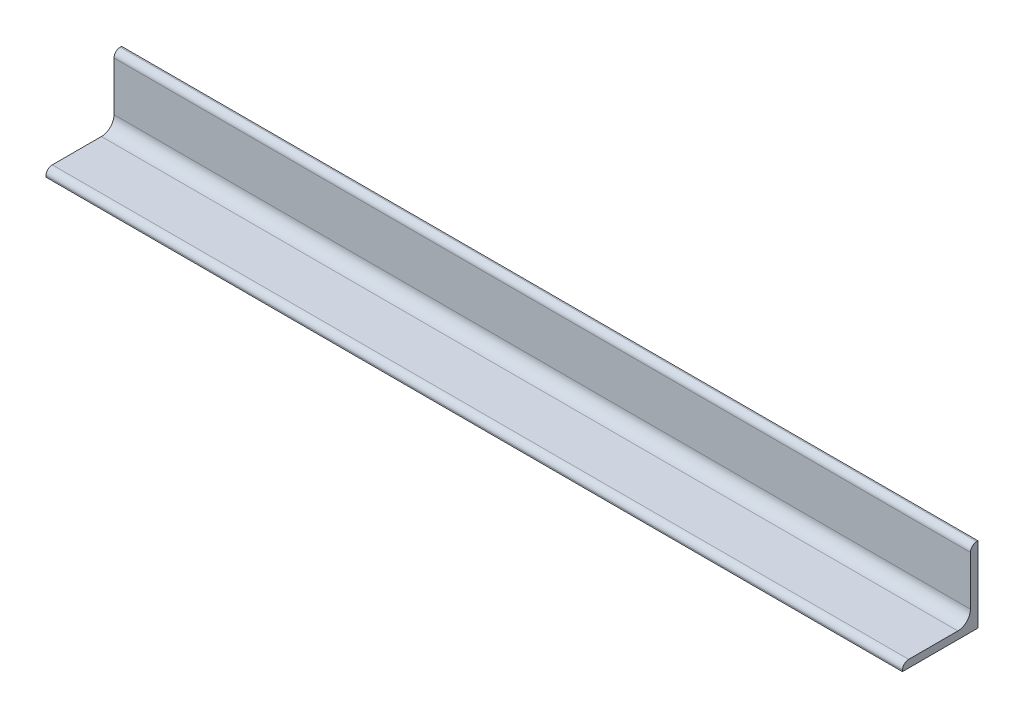
ISO-10303-21;
HEADER;
FILE_DESCRIPTION(('STEP AP214'),'2;1');
FILE_NAME('part.step','',(''),(''),'','','');
FILE_SCHEMA(('AUTOMOTIVE_DESIGN { 1 0 10303 214 1 1 1 1 }'));
ENDSEC;
DATA;
#1=APPLICATION_CONTEXT('core data for automotive mechanical design processes');
#2=APPLICATION_PROTOCOL_DEFINITION('international standard','automotive_design',2000,#1);
#3=PRODUCT_CONTEXT('',#1,'mechanical');
#4=PRODUCT('Part','Part','',(#3));
#5=PRODUCT_RELATED_PRODUCT_CATEGORY('part','',(#4));
#6=PRODUCT_DEFINITION_FORMATION('','',#4);
#7=PRODUCT_DEFINITION_CONTEXT('part definition',#1,'design');
#8=PRODUCT_DEFINITION('design','',#6,#7);
#9=PRODUCT_DEFINITION_SHAPE('','',#8);
#10=(LENGTH_UNIT() NAMED_UNIT(*) SI_UNIT(.MILLI.,.METRE.));
#11=(NAMED_UNIT(*) PLANE_ANGLE_UNIT() SI_UNIT($,.RADIAN.));
#12=(NAMED_UNIT(*) SI_UNIT($,.STERADIAN.) SOLID_ANGLE_UNIT());
#13=UNCERTAINTY_MEASURE_WITH_UNIT(LENGTH_MEASURE(1.E-05),#10,'distance_accuracy_value','');
#14=(GEOMETRIC_REPRESENTATION_CONTEXT(3) GLOBAL_UNCERTAINTY_ASSIGNED_CONTEXT((#13)) GLOBAL_UNIT_ASSIGNED_CONTEXT((#10,
#11,#12)) REPRESENTATION_CONTEXT('',''));
#15=CARTESIAN_POINT('',(0.,0.,0.));
#16=DIRECTION('',(0.,0.,1.));
#17=DIRECTION('',(1.,0.,0.));
#18=AXIS2_PLACEMENT_3D('',#15,#16,#17);
#19=CARTESIAN_POINT('',(-170.,27.5,0.500000000000005));
#20=DIRECTION('',(1.,0.,0.));
#21=DIRECTION('',(0.,0.,-1.));
#22=AXIS2_PLACEMENT_3D('',#19,#20,#21);
#23=PLANE('',#22);
#24=DIRECTION('',(0.,0.,1.));
#25=VECTOR('',#24,1.);
#26=CARTESIAN_POINT('',(-170.,0.,30.));
#27=LINE('',#26,#25);
#28=CARTESIAN_POINT('',(-170.,0.,0.));
#29=VERTEX_POINT('',#28);
#30=CARTESIAN_POINT('',(-170.,0.,30.));
#31=VERTEX_POINT('',#30);
#32=EDGE_CURVE('E124',#29,#31,#27,.T.);
#33=ORIENTED_EDGE('',*,*,#32,.T.);
#34=DIRECTION('',(0.,1.,0.));
#35=VECTOR('',#34,1.);
#36=CARTESIAN_POINT('',(-170.,0.499999999999992,30.));
#37=LINE('',#36,#35);
#38=CARTESIAN_POINT('',(-170.,0.499999999999992,30.));
#39=VERTEX_POINT('',#38);
#40=EDGE_CURVE('E131',#31,#39,#37,.T.);
#41=ORIENTED_EDGE('',*,*,#40,.T.);
#42=CARTESIAN_POINT('',(-170.,0.499999999999992,27.5));
#43=DIRECTION('',(-1.,0.,0.));
#44=DIRECTION('',(0.,0.,1.));
#45=AXIS2_PLACEMENT_3D('',#42,#43,#44);
#46=CIRCLE('',#45,2.5);
#47=CARTESIAN_POINT('',(-170.,2.99999999999999,27.5));
#48=VERTEX_POINT('',#47);
#49=EDGE_CURVE('E141',#39,#48,#46,.T.);
#50=ORIENTED_EDGE('',*,*,#49,.T.);
#51=DIRECTION('',(0.,0.,-1.));
#52=VECTOR('',#51,1.);
#53=CARTESIAN_POINT('',(-170.,2.99999999999999,8.00000000000001));
#54=LINE('',#53,#52);
#55=CARTESIAN_POINT('',(-170.,3.,8.00000000000001));
#56=VERTEX_POINT('',#55);
#57=EDGE_CURVE('E150',#48,#56,#54,.T.);
#58=ORIENTED_EDGE('',*,*,#57,.T.);
#59=CARTESIAN_POINT('',(-170.,8.,8.00000000000001));
#60=DIRECTION('',(1.,0.,0.));
#61=DIRECTION('',(0.,0.,-1.));
#62=AXIS2_PLACEMENT_3D('',#59,#60,#61);
#63=CIRCLE('',#62,5.);
#64=CARTESIAN_POINT('',(-170.,8.,3.00000000000001));
#65=VERTEX_POINT('',#64);
#66=EDGE_CURVE('E158',#56,#65,#63,.T.);
#67=ORIENTED_EDGE('',*,*,#66,.T.);
#68=DIRECTION('',(0.,1.,0.));
#69=VECTOR('',#68,1.);
#70=CARTESIAN_POINT('',(-170.,27.5,3.));
#71=LINE('',#70,#69);
#72=CARTESIAN_POINT('',(-170.,27.5,3.00000000000001));
#73=VERTEX_POINT('',#72);
#74=EDGE_CURVE('E166',#65,#73,#71,.T.);
#75=ORIENTED_EDGE('',*,*,#74,.T.);
#76=CARTESIAN_POINT('',(-170.,27.5,0.500000000000005));
#77=DIRECTION('',(-1.,0.,0.));
#78=DIRECTION('',(0.,0.,-1.));
#79=AXIS2_PLACEMENT_3D('',#76,#77,#78);
#80=CIRCLE('',#79,2.5);
#81=CARTESIAN_POINT('',(-170.,30.,0.500000000000005));
#82=VERTEX_POINT('',#81);
#83=EDGE_CURVE('E88',#73,#82,#80,.T.);
#84=ORIENTED_EDGE('',*,*,#83,.T.);
#85=DIRECTION('',(0.,0.,-1.));
#86=VECTOR('',#85,1.);
#87=CARTESIAN_POINT('',(-170.,30.,0.));
#88=LINE('',#87,#86);
#89=CARTESIAN_POINT('',(-170.,30.,0.));
#90=VERTEX_POINT('',#89);
#91=EDGE_CURVE('E83',#82,#90,#88,.T.);
#92=ORIENTED_EDGE('',*,*,#91,.T.);
#93=DIRECTION('',(0.,-1.,0.));
#94=VECTOR('',#93,1.);
#95=CARTESIAN_POINT('',(-170.,30.,0.));
#96=LINE('',#95,#94);
#97=EDGE_CURVE('E77',#90,#29,#96,.T.);
#98=ORIENTED_EDGE('',*,*,#97,.T.);
#99=EDGE_LOOP('',(#33,#41,#50,#58,#67,#75,#84,#92,#98));
#100=FACE_BOUND('',#99,.T.);
#101=ADVANCED_FACE('F41',(#100),#23,.F.);
#102=CARTESIAN_POINT('',(170.,27.5,0.500000000000005));
#103=DIRECTION('',(1.,0.,0.));
#104=DIRECTION('',(0.,0.,-1.));
#105=AXIS2_PLACEMENT_3D('',#102,#103,#104);
#106=PLANE('',#105);
#107=DIRECTION('',(0.,0.,1.));
#108=VECTOR('',#107,1.);
#109=CARTESIAN_POINT('',(170.,0.,30.));
#110=LINE('',#109,#108);
#111=CARTESIAN_POINT('',(170.,0.,0.));
#112=VERTEX_POINT('',#111);
#113=CARTESIAN_POINT('',(170.,0.,30.));
#114=VERTEX_POINT('',#113);
#115=EDGE_CURVE('E135',#112,#114,#110,.T.);
#116=ORIENTED_EDGE('',*,*,#115,.F.);
#117=DIRECTION('',(0.,-1.,0.));
#118=VECTOR('',#117,1.);
#119=CARTESIAN_POINT('',(170.,30.,0.));
#120=LINE('',#119,#118);
#121=CARTESIAN_POINT('',(170.,30.,0.));
#122=VERTEX_POINT('',#121);
#123=EDGE_CURVE('E11',#122,#112,#120,.T.);
#124=ORIENTED_EDGE('',*,*,#123,.F.);
#125=DIRECTION('',(0.,0.,-1.));
#126=VECTOR('',#125,1.);
#127=CARTESIAN_POINT('',(170.,30.,0.));
#128=LINE('',#127,#126);
#129=CARTESIAN_POINT('',(170.,30.,0.500000000000005));
#130=VERTEX_POINT('',#129);
#131=EDGE_CURVE('E55',#130,#122,#128,.T.);
#132=ORIENTED_EDGE('',*,*,#131,.F.);
#133=CARTESIAN_POINT('',(170.,27.5,0.500000000000005));
#134=DIRECTION('',(-1.,0.,0.));
#135=DIRECTION('',(0.,0.,-1.));
#136=AXIS2_PLACEMENT_3D('',#133,#134,#135);
#137=CIRCLE('',#136,2.5);
#138=CARTESIAN_POINT('',(170.,27.5,3.00000000000001));
#139=VERTEX_POINT('',#138);
#140=EDGE_CURVE('E64',#139,#130,#137,.T.);
#141=ORIENTED_EDGE('',*,*,#140,.F.);
#142=DIRECTION('',(0.,1.,0.));
#143=VECTOR('',#142,1.);
#144=CARTESIAN_POINT('',(170.,27.5,3.));
#145=LINE('',#144,#143);
#146=CARTESIAN_POINT('',(170.,8.,3.00000000000001));
#147=VERTEX_POINT('',#146);
#148=EDGE_CURVE('E171',#147,#139,#145,.T.);
#149=ORIENTED_EDGE('',*,*,#148,.F.);
#150=CARTESIAN_POINT('',(170.,8.,8.00000000000001));
#151=DIRECTION('',(1.,0.,0.));
#152=DIRECTION('',(0.,0.,-1.));
#153=AXIS2_PLACEMENT_3D('',#150,#151,#152);
#154=CIRCLE('',#153,5.);
#155=CARTESIAN_POINT('',(170.,3.,8.00000000000001));
#156=VERTEX_POINT('',#155);
#157=EDGE_CURVE('E163',#156,#147,#154,.T.);
#158=ORIENTED_EDGE('',*,*,#157,.F.);
#159=DIRECTION('',(0.,0.,-1.));
#160=VECTOR('',#159,1.);
#161=CARTESIAN_POINT('',(170.,2.99999999999999,8.00000000000001));
#162=LINE('',#161,#160);
#163=CARTESIAN_POINT('',(170.,2.99999999999999,27.5));
#164=VERTEX_POINT('',#163);
#165=EDGE_CURVE('E155',#164,#156,#162,.T.);
#166=ORIENTED_EDGE('',*,*,#165,.F.);
#167=CARTESIAN_POINT('',(170.,0.499999999999992,27.5));
#168=DIRECTION('',(-1.,0.,0.));
#169=DIRECTION('',(0.,0.,1.));
#170=AXIS2_PLACEMENT_3D('',#167,#168,#169);
#171=CIRCLE('',#170,2.5);
#172=CARTESIAN_POINT('',(170.,0.499999999999992,30.));
#173=VERTEX_POINT('',#172);
#174=EDGE_CURVE('E147',#173,#164,#171,.T.);
#175=ORIENTED_EDGE('',*,*,#174,.F.);
#176=DIRECTION('',(0.,1.,0.));
#177=VECTOR('',#176,1.);
#178=CARTESIAN_POINT('',(170.,0.499999999999992,30.));
#179=LINE('',#178,#177);
#180=EDGE_CURVE('E142',#114,#173,#179,.T.);
#181=ORIENTED_EDGE('',*,*,#180,.F.);
#182=EDGE_LOOP('',(#116,#124,#132,#141,#149,#158,#166,#175,#181));
#183=FACE_BOUND('',#182,.T.);
#184=ADVANCED_FACE('F194',(#183),#106,.T.);
#185=CARTESIAN_POINT('',(-170.,0.,30.));
#186=DIRECTION('',(0.,1.,0.));
#187=DIRECTION('',(0.,0.,1.));
#188=AXIS2_PLACEMENT_3D('',#185,#186,#187);
#189=PLANE('',#188);
#190=DIRECTION('',(1.,0.,0.));
#191=VECTOR('',#190,1.);
#192=CARTESIAN_POINT('',(-170.,0.,30.));
#193=LINE('',#192,#191);
#194=EDGE_CURVE('E128',#31,#114,#193,.T.);
#195=ORIENTED_EDGE('',*,*,#194,.F.);
#196=ORIENTED_EDGE('',*,*,#32,.F.);
#197=DIRECTION('',(1.,0.,0.));
#198=VECTOR('',#197,1.);
#199=CARTESIAN_POINT('',(-170.,0.,0.));
#200=LINE('',#199,#198);
#201=EDGE_CURVE('E126',#29,#112,#200,.T.);
#202=ORIENTED_EDGE('',*,*,#201,.T.);
#203=ORIENTED_EDGE('',*,*,#115,.T.);
#204=EDGE_LOOP('',(#195,#196,#202,#203));
#205=FACE_BOUND('',#204,.T.);
#206=ADVANCED_FACE('F125',(#205),#189,.F.);
#207=CARTESIAN_POINT('',(-170.,0.499999999999992,30.));
#208=DIRECTION('',(0.,0.,-1.));
#209=DIRECTION('',(-1.,0.,0.));
#210=AXIS2_PLACEMENT_3D('',#207,#208,#209);
#211=PLANE('',#210);
#212=DIRECTION('',(1.,0.,0.));
#213=VECTOR('',#212,1.);
#214=CARTESIAN_POINT('',(-170.,0.499999999999992,30.));
#215=LINE('',#214,#213);
#216=EDGE_CURVE('E144',#39,#173,#215,.T.);
#217=ORIENTED_EDGE('',*,*,#216,.F.);
#218=ORIENTED_EDGE('',*,*,#40,.F.);
#219=ORIENTED_EDGE('',*,*,#194,.T.);
#220=ORIENTED_EDGE('',*,*,#180,.T.);
#221=EDGE_LOOP('',(#217,#218,#219,#220));
#222=FACE_BOUND('',#221,.T.);
#223=ADVANCED_FACE('F201',(#222),#211,.F.);
#224=CARTESIAN_POINT('',(-170.,0.499999999999992,27.5));
#225=DIRECTION('',(1.,0.,0.));
#226=DIRECTION('',(0.,0.,-1.));
#227=AXIS2_PLACEMENT_3D('',#224,#225,#226);
#228=CYLINDRICAL_SURFACE('',#227,2.5);
#229=DIRECTION('',(1.,0.,0.));
#230=VECTOR('',#229,1.);
#231=CARTESIAN_POINT('',(-170.,2.99999999999999,27.5));
#232=LINE('',#231,#230);
#233=EDGE_CURVE('E152',#48,#164,#232,.T.);
#234=ORIENTED_EDGE('',*,*,#233,.F.);
#235=ORIENTED_EDGE('',*,*,#49,.F.);
#236=ORIENTED_EDGE('',*,*,#216,.T.);
#237=ORIENTED_EDGE('',*,*,#174,.T.);
#238=EDGE_LOOP('',(#234,#235,#236,#237));
#239=FACE_BOUND('',#238,.T.);
#240=ADVANCED_FACE('F211',(#239),#228,.T.);
#241=CARTESIAN_POINT('',(-170.,2.99999999999999,8.00000000000001));
#242=DIRECTION('',(0.,-1.,0.));
#243=DIRECTION('',(0.,0.,-1.));
#244=AXIS2_PLACEMENT_3D('',#241,#242,#243);
#245=PLANE('',#244);
#246=DIRECTION('',(1.,0.,0.));
#247=VECTOR('',#246,1.);
#248=CARTESIAN_POINT('',(-170.,3.,8.00000000000001));
#249=LINE('',#248,#247);
#250=EDGE_CURVE('E160',#56,#156,#249,.T.);
#251=ORIENTED_EDGE('',*,*,#250,.F.);
#252=ORIENTED_EDGE('',*,*,#57,.F.);
#253=ORIENTED_EDGE('',*,*,#233,.T.);
#254=ORIENTED_EDGE('',*,*,#165,.T.);
#255=EDGE_LOOP('',(#251,#252,#253,#254));
#256=FACE_BOUND('',#255,.T.);
#257=ADVANCED_FACE('F213',(#256),#245,.F.);
#258=CARTESIAN_POINT('',(-170.,8.,8.00000000000001));
#259=DIRECTION('',(1.,0.,0.));
#260=DIRECTION('',(0.,0.,-1.));
#261=AXIS2_PLACEMENT_3D('',#258,#259,#260);
#262=CYLINDRICAL_SURFACE('',#261,5.);
#263=DIRECTION('',(1.,0.,0.));
#264=VECTOR('',#263,1.);
#265=CARTESIAN_POINT('',(-170.,8.,3.00000000000001));
#266=LINE('',#265,#264);
#267=EDGE_CURVE('E168',#65,#147,#266,.T.);
#268=ORIENTED_EDGE('',*,*,#267,.F.);
#269=ORIENTED_EDGE('',*,*,#66,.F.);
#270=ORIENTED_EDGE('',*,*,#250,.T.);
#271=ORIENTED_EDGE('',*,*,#157,.T.);
#272=EDGE_LOOP('',(#268,#269,#270,#271));
#273=FACE_BOUND('',#272,.T.);
#274=ADVANCED_FACE('F217',(#273),#262,.F.);
#275=CARTESIAN_POINT('',(-170.,27.5,3.));
#276=DIRECTION('',(0.,0.,-1.));
#277=DIRECTION('',(0.,1.,0.));
#278=AXIS2_PLACEMENT_3D('',#275,#276,#277);
#279=PLANE('',#278);
#280=DIRECTION('',(1.,0.,0.));
#281=VECTOR('',#280,1.);
#282=CARTESIAN_POINT('',(-170.,27.5,3.00000000000001));
#283=LINE('',#282,#281);
#284=EDGE_CURVE('E174',#73,#139,#283,.T.);
#285=ORIENTED_EDGE('',*,*,#284,.F.);
#286=ORIENTED_EDGE('',*,*,#74,.F.);
#287=ORIENTED_EDGE('',*,*,#267,.T.);
#288=ORIENTED_EDGE('',*,*,#148,.T.);
#289=EDGE_LOOP('',(#285,#286,#287,#288));
#290=FACE_BOUND('',#289,.T.);
#291=ADVANCED_FACE('F191',(#290),#279,.F.);
#292=CARTESIAN_POINT('',(-170.,27.5,0.500000000000005));
#293=DIRECTION('',(1.,0.,0.));
#294=DIRECTION('',(0.,0.,-1.));
#295=AXIS2_PLACEMENT_3D('',#292,#293,#294);
#296=CYLINDRICAL_SURFACE('',#295,2.5);
#297=DIRECTION('',(1.,0.,0.));
#298=VECTOR('',#297,1.);
#299=CARTESIAN_POINT('',(-170.,30.,0.500000000000005));
#300=LINE('',#299,#298);
#301=EDGE_CURVE('E178',#82,#130,#300,.T.);
#302=ORIENTED_EDGE('',*,*,#301,.F.);
#303=ORIENTED_EDGE('',*,*,#83,.F.);
#304=ORIENTED_EDGE('',*,*,#284,.T.);
#305=ORIENTED_EDGE('',*,*,#140,.T.);
#306=EDGE_LOOP('',(#302,#303,#304,#305));
#307=FACE_BOUND('',#306,.T.);
#308=ADVANCED_FACE('F184',(#307),#296,.T.);
#309=CARTESIAN_POINT('',(-170.,30.,0.));
#310=DIRECTION('',(0.,-1.,0.));
#311=DIRECTION('',(0.,0.,-1.));
#312=AXIS2_PLACEMENT_3D('',#309,#310,#311);
#313=PLANE('',#312);
#314=DIRECTION('',(1.,0.,0.));
#315=VECTOR('',#314,1.);
#316=CARTESIAN_POINT('',(-170.,30.,0.));
#317=LINE('',#316,#315);
#318=EDGE_CURVE('E48',#90,#122,#317,.T.);
#319=ORIENTED_EDGE('',*,*,#318,.F.);
#320=ORIENTED_EDGE('',*,*,#91,.F.);
#321=ORIENTED_EDGE('',*,*,#301,.T.);
#322=ORIENTED_EDGE('',*,*,#131,.T.);
#323=EDGE_LOOP('',(#319,#320,#321,#322));
#324=FACE_BOUND('',#323,.T.);
#325=ADVANCED_FACE('F182',(#324),#313,.F.);
#326=CARTESIAN_POINT('',(-170.,30.,0.));
#327=DIRECTION('',(0.,0.,1.));
#328=DIRECTION('',(0.,-1.,0.));
#329=AXIS2_PLACEMENT_3D('',#326,#327,#328);
#330=PLANE('',#329);
#331=ORIENTED_EDGE('',*,*,#123,.T.);
#332=ORIENTED_EDGE('',*,*,#201,.F.);
#333=ORIENTED_EDGE('',*,*,#97,.F.);
#334=ORIENTED_EDGE('',*,*,#318,.T.);
#335=EDGE_LOOP('',(#331,#332,#333,#334));
#336=FACE_BOUND('',#335,.T.);
#337=ADVANCED_FACE('F133',(#336),#330,.F.);
#338=CLOSED_SHELL('',(#101,#184,#206,#223,#240,#257,#274,#291,#308,#325,#337));
#339=MANIFOLD_SOLID_BREP('B2',#338);
#340=ADVANCED_BREP_SHAPE_REPRESENTATION('',(#18,#339),#14);
#341=SHAPE_DEFINITION_REPRESENTATION(#9,#340);
ENDSEC;
END-ISO-10303-21;
